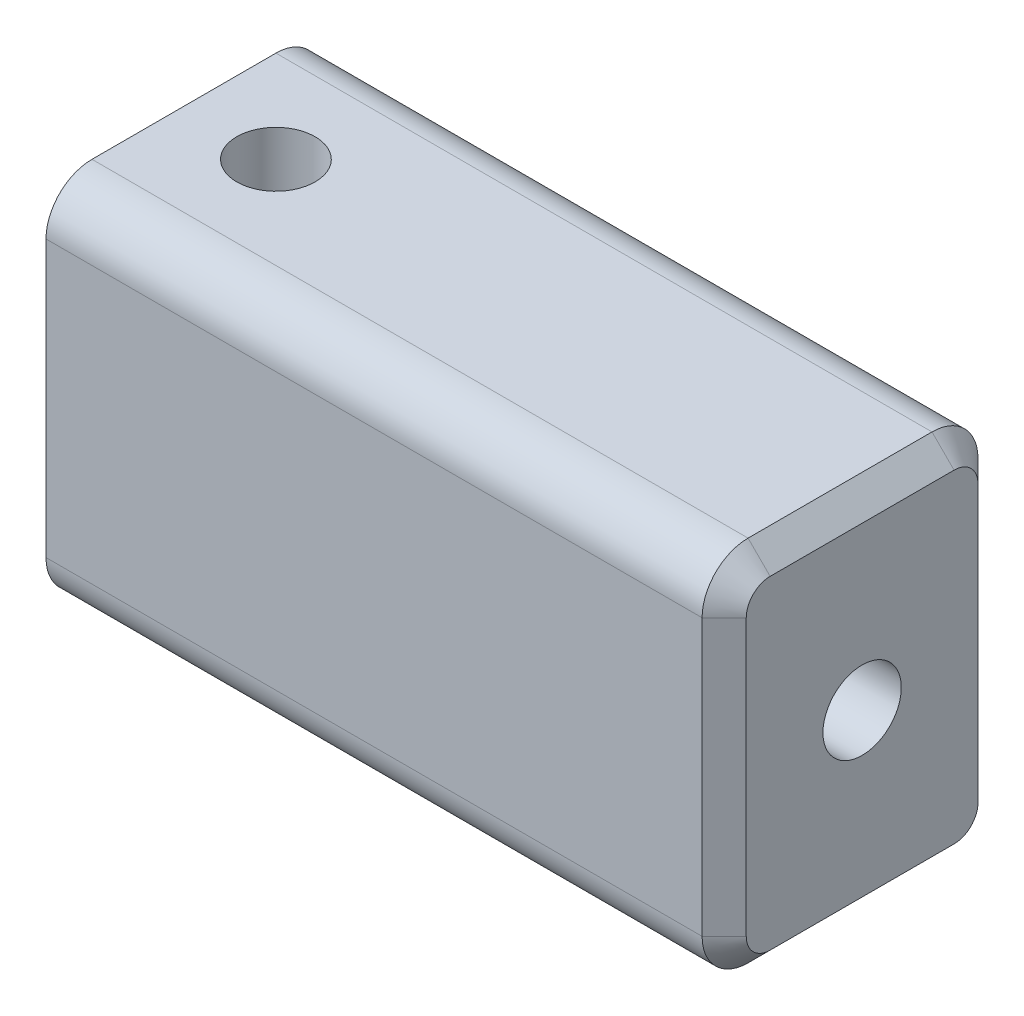
ISO-10303-21;
HEADER;
FILE_DESCRIPTION(('STEP AP214'),'2;1');
FILE_NAME('part.step','',(''),(''),'','','');
FILE_SCHEMA(('AUTOMOTIVE_DESIGN { 1 0 10303 214 1 1 1 1 }'));
ENDSEC;
DATA;
#1=APPLICATION_CONTEXT('core data for automotive mechanical design processes');
#2=APPLICATION_PROTOCOL_DEFINITION('international standard','automotive_design',2000,#1);
#3=PRODUCT_CONTEXT('',#1,'mechanical');
#4=PRODUCT('Part','Part','',(#3));
#5=PRODUCT_RELATED_PRODUCT_CATEGORY('part','',(#4));
#6=PRODUCT_DEFINITION_FORMATION('','',#4);
#7=PRODUCT_DEFINITION_CONTEXT('part definition',#1,'design');
#8=PRODUCT_DEFINITION('design','',#6,#7);
#9=PRODUCT_DEFINITION_SHAPE('','',#8);
#10=(LENGTH_UNIT() NAMED_UNIT(*) SI_UNIT(.MILLI.,.METRE.));
#11=(NAMED_UNIT(*) PLANE_ANGLE_UNIT() SI_UNIT($,.RADIAN.));
#12=(NAMED_UNIT(*) SI_UNIT($,.STERADIAN.) SOLID_ANGLE_UNIT());
#13=UNCERTAINTY_MEASURE_WITH_UNIT(LENGTH_MEASURE(1.E-05),#10,'distance_accuracy_value','');
#14=(GEOMETRIC_REPRESENTATION_CONTEXT(3) GLOBAL_UNCERTAINTY_ASSIGNED_CONTEXT((#13)) GLOBAL_UNIT_ASSIGNED_CONTEXT((#10,
#11,#12)) REPRESENTATION_CONTEXT('',''));
#15=CARTESIAN_POINT('',(0.,0.,0.));
#16=DIRECTION('',(0.,0.,1.));
#17=DIRECTION('',(1.,0.,0.));
#18=AXIS2_PLACEMENT_3D('',#15,#16,#17);
#19=CARTESIAN_POINT('',(39.28745,6.35,-4.7625));
#20=DIRECTION('',(0.,1.,0.));
#21=DIRECTION('',(0.,0.,1.));
#22=AXIS2_PLACEMENT_3D('',#19,#20,#21);
#23=PLANE('',#22);
#24=DIRECTION('',(-1.,0.,0.));
#25=VECTOR('',#24,1.);
#26=CARTESIAN_POINT('',(39.28745,6.35,3.175));
#27=LINE('',#26,#25);
#28=CARTESIAN_POINT('',(0.,6.35,3.175));
#29=VERTEX_POINT('',#28);
#30=CARTESIAN_POINT('',(22.65045,6.35,3.175));
#31=VERTEX_POINT('',#30);
#32=EDGE_CURVE('E518',#29,#31,#27,.F.);
#33=ORIENTED_EDGE('',*,*,#32,.T.);
#34=DIRECTION('',(0.,0.,-1.));
#35=VECTOR('',#34,1.);
#36=CARTESIAN_POINT('',(22.65045,6.35,-3.175));
#37=LINE('',#36,#35);
#38=CARTESIAN_POINT('',(22.65045,6.35,-3.175));
#39=VERTEX_POINT('',#38);
#40=EDGE_CURVE('E12',#31,#39,#37,.T.);
#41=ORIENTED_EDGE('',*,*,#40,.T.);
#42=DIRECTION('',(-1.,0.,0.));
#43=VECTOR('',#42,1.);
#44=CARTESIAN_POINT('',(39.28745,6.35,-3.175));
#45=LINE('',#44,#43);
#46=CARTESIAN_POINT('',(0.,6.35,-3.175));
#47=VERTEX_POINT('',#46);
#48=EDGE_CURVE('E520',#39,#47,#45,.T.);
#49=ORIENTED_EDGE('',*,*,#48,.T.);
#50=DIRECTION('',(0.,0.,-1.));
#51=VECTOR('',#50,1.);
#52=CARTESIAN_POINT('',(0.,6.35,-4.7625));
#53=LINE('',#52,#51);
#54=EDGE_CURVE('E497',#29,#47,#53,.T.);
#55=ORIENTED_EDGE('',*,*,#54,.F.);
#56=EDGE_LOOP('',(#33,#41,#49,#55));
#57=FACE_BOUND('',#56,.T.);
#58=CARTESIAN_POINT('',(3.175,6.35,0.));
#59=DIRECTION('',(0.,1.,0.));
#60=DIRECTION('',(0.,0.,1.));
#61=AXIS2_PLACEMENT_3D('',#58,#59,#60);
#62=CIRCLE('',#61,1.35255);
#63=CARTESIAN_POINT('',(3.175,6.35,1.35255));
#64=VERTEX_POINT('',#63);
#65=EDGE_CURVE('E468',#64,#64,#62,.T.);
#66=ORIENTED_EDGE('',*,*,#65,.F.);
#67=EDGE_LOOP('',(#66));
#68=FACE_BOUND('',#67,.T.);
#69=ADVANCED_FACE('F361',(#57,#68),#23,.T.);
#70=CARTESIAN_POINT('',(23.41345,0.,0.));
#71=DIRECTION('',(-1.,0.,0.));
#72=DIRECTION('',(0.,0.,1.));
#73=AXIS2_PLACEMENT_3D('',#70,#71,#72);
#74=CYLINDRICAL_SURFACE('',#73,1.35255);
#75=CARTESIAN_POINT('',(0.,0.,0.));
#76=DIRECTION('',(-1.,0.,0.));
#77=DIRECTION('',(0.,0.,1.));
#78=AXIS2_PLACEMENT_3D('',#75,#76,#77);
#79=CIRCLE('',#78,1.35255);
#80=CARTESIAN_POINT('',(0.,0.,1.35255));
#81=VERTEX_POINT('',#80);
#82=EDGE_CURVE('E482',#81,#81,#79,.T.);
#83=ORIENTED_EDGE('',*,*,#82,.T.);
#84=EDGE_LOOP('',(#83));
#85=FACE_BOUND('',#84,.T.);
#86=CARTESIAN_POINT('',(3.175,0.,0.));
#87=DIRECTION('',(-0.707106781186547,-0.707106781186547,0.));
#88=DIRECTION('',(0.707106781186547,-0.707106781186547,0.));
#89=AXIS2_PLACEMENT_3D('',#86,#87,#88);
#90=ELLIPSE('',#89,1.91279455378773,1.35255);
#91=CARTESIAN_POINT('',(3.175,0.,-1.35255));
#92=VERTEX_POINT('',#91);
#93=CARTESIAN_POINT('',(3.175,0.,1.35255));
#94=VERTEX_POINT('',#93);
#95=EDGE_CURVE('E457',#92,#94,#90,.F.);
#96=ORIENTED_EDGE('',*,*,#95,.T.);
#97=CARTESIAN_POINT('',(3.175,0.,0.));
#98=DIRECTION('',(-0.707106781186547,0.707106781186547,0.));
#99=DIRECTION('',(0.707106781186547,0.707106781186547,0.));
#100=AXIS2_PLACEMENT_3D('',#97,#98,#99);
#101=ELLIPSE('',#100,1.91279455378773,1.35255);
#102=EDGE_CURVE('E467',#92,#94,#101,.T.);
#103=ORIENTED_EDGE('',*,*,#102,.F.);
#104=EDGE_LOOP('',(#96,#103));
#105=FACE_BOUND('',#104,.T.);
#106=ADVANCED_FACE('F466',(#85,#105),#74,.F.);
#107=CARTESIAN_POINT('',(23.41245,0.,0.));
#108=DIRECTION('',(-1.,0.,0.));
#109=DIRECTION('',(0.,0.,1.));
#110=AXIS2_PLACEMENT_3D('',#107,#108,#109);
#111=CIRCLE('',#110,1.35255);
#112=CARTESIAN_POINT('',(23.41245,0.,1.35255));
#113=VERTEX_POINT('',#112);
#114=EDGE_CURVE('E485',#113,#113,#111,.F.);
#115=ORIENTED_EDGE('',*,*,#114,.T.);
#116=EDGE_LOOP('',(#115));
#117=FACE_BOUND('',#116,.T.);
#118=CARTESIAN_POINT('',(3.175,0.,0.));
#119=DIRECTION('',(0.707106781186547,-0.707106781186547,0.));
#120=DIRECTION('',(-0.707106781186547,-0.707106781186547,0.));
#121=AXIS2_PLACEMENT_3D('',#118,#119,#120);
#122=ELLIPSE('',#121,1.91279455378773,1.35255);
#123=EDGE_CURVE('E454',#94,#92,#122,.F.);
#124=ORIENTED_EDGE('',*,*,#123,.T.);
#125=CARTESIAN_POINT('',(3.175,0.,0.));
#126=DIRECTION('',(0.707106781186547,0.707106781186547,0.));
#127=DIRECTION('',(-0.707106781186547,0.707106781186547,0.));
#128=AXIS2_PLACEMENT_3D('',#125,#126,#127);
#129=ELLIPSE('',#128,1.91279455378773,1.35255);
#130=EDGE_CURVE('E472',#94,#92,#129,.T.);
#131=ORIENTED_EDGE('',*,*,#130,.F.);
#132=EDGE_LOOP('',(#124,#131));
#133=FACE_BOUND('',#132,.T.);
#134=ADVANCED_FACE('F475',(#117,#133),#74,.F.);
#135=CARTESIAN_POINT('',(0.,0.,0.));
#136=DIRECTION('',(1.,0.,0.));
#137=DIRECTION('',(0.,0.,-1.));
#138=AXIS2_PLACEMENT_3D('',#135,#136,#137);
#139=PLANE('',#138);
#140=ORIENTED_EDGE('',*,*,#82,.F.);
#141=EDGE_LOOP('',(#140));
#142=FACE_BOUND('',#141,.T.);
#143=DIRECTION('',(0.,-1.,0.));
#144=VECTOR('',#143,1.);
#145=CARTESIAN_POINT('',(0.,-6.35,-4.7625));
#146=LINE('',#145,#144);
#147=CARTESIAN_POINT('',(0.,4.7625,-4.7625));
#148=VERTEX_POINT('',#147);
#149=CARTESIAN_POINT('',(0.,-4.7625,-4.7625));
#150=VERTEX_POINT('',#149);
#151=EDGE_CURVE('E488',#148,#150,#146,.T.);
#152=ORIENTED_EDGE('',*,*,#151,.T.);
#153=CARTESIAN_POINT('',(0.,-4.7625,-3.175));
#154=DIRECTION('',(1.,0.,0.));
#155=DIRECTION('',(0.,0.,-1.));
#156=AXIS2_PLACEMENT_3D('',#153,#154,#155);
#157=CIRCLE('',#156,1.5875);
#158=CARTESIAN_POINT('',(0.,-6.35,-3.175));
#159=VERTEX_POINT('',#158);
#160=EDGE_CURVE('E511',#150,#159,#157,.F.);
#161=ORIENTED_EDGE('',*,*,#160,.T.);
#162=DIRECTION('',(0.,0.,1.));
#163=VECTOR('',#162,1.);
#164=CARTESIAN_POINT('',(0.,-6.35,-4.7625));
#165=LINE('',#164,#163);
#166=CARTESIAN_POINT('',(0.,-6.35,3.175));
#167=VERTEX_POINT('',#166);
#168=EDGE_CURVE('E491',#159,#167,#165,.T.);
#169=ORIENTED_EDGE('',*,*,#168,.T.);
#170=CARTESIAN_POINT('',(0.,-4.7625,3.175));
#171=DIRECTION('',(1.,0.,0.));
#172=DIRECTION('',(0.,0.,-1.));
#173=AXIS2_PLACEMENT_3D('',#170,#171,#172);
#174=CIRCLE('',#173,1.5875);
#175=CARTESIAN_POINT('',(0.,-4.7625,4.7625));
#176=VERTEX_POINT('',#175);
#177=EDGE_CURVE('E505',#167,#176,#174,.F.);
#178=ORIENTED_EDGE('',*,*,#177,.T.);
#179=DIRECTION('',(0.,1.,0.));
#180=VECTOR('',#179,1.);
#181=CARTESIAN_POINT('',(0.,-6.35,4.7625));
#182=LINE('',#181,#180);
#183=CARTESIAN_POINT('',(0.,4.7625,4.7625));
#184=VERTEX_POINT('',#183);
#185=EDGE_CURVE('E494',#176,#184,#182,.T.);
#186=ORIENTED_EDGE('',*,*,#185,.T.);
#187=CARTESIAN_POINT('',(0.,4.7625,3.175));
#188=DIRECTION('',(1.,0.,0.));
#189=DIRECTION('',(0.,0.,-1.));
#190=AXIS2_PLACEMENT_3D('',#187,#188,#189);
#191=CIRCLE('',#190,1.5875);
#192=EDGE_CURVE('E507',#184,#29,#191,.F.);
#193=ORIENTED_EDGE('',*,*,#192,.T.);
#194=ORIENTED_EDGE('',*,*,#54,.T.);
#195=CARTESIAN_POINT('',(0.,4.7625,-3.175));
#196=DIRECTION('',(1.,0.,0.));
#197=DIRECTION('',(0.,0.,-1.));
#198=AXIS2_PLACEMENT_3D('',#195,#196,#197);
#199=CIRCLE('',#198,1.5875);
#200=EDGE_CURVE('E509',#47,#148,#199,.F.);
#201=ORIENTED_EDGE('',*,*,#200,.T.);
#202=EDGE_LOOP('',(#152,#161,#169,#178,#186,#193,#194,#201));
#203=FACE_BOUND('',#202,.T.);
#204=ADVANCED_FACE('F363',(#142,#203),#139,.F.);
#205=CARTESIAN_POINT('',(39.28745,-6.35,-4.7625));
#206=DIRECTION('',(0.,0.,-1.));
#207=DIRECTION('',(-1.,0.,0.));
#208=AXIS2_PLACEMENT_3D('',#205,#206,#207);
#209=PLANE('',#208);
#210=DIRECTION('',(-1.,0.,0.));
#211=VECTOR('',#210,1.);
#212=CARTESIAN_POINT('',(39.28745,4.7625,-4.7625));
#213=LINE('',#212,#211);
#214=CARTESIAN_POINT('',(22.65045,4.7625,-4.7625));
#215=VERTEX_POINT('',#214);
#216=EDGE_CURVE('E500',#148,#215,#213,.F.);
#217=ORIENTED_EDGE('',*,*,#216,.T.);
#218=DIRECTION('',(0.,-1.,0.));
#219=VECTOR('',#218,1.);
#220=CARTESIAN_POINT('',(22.65045,-4.7625,-4.7625));
#221=LINE('',#220,#219);
#222=CARTESIAN_POINT('',(22.65045,-4.7625,-4.7625));
#223=VERTEX_POINT('',#222);
#224=EDGE_CURVE('E551',#215,#223,#221,.T.);
#225=ORIENTED_EDGE('',*,*,#224,.T.);
#226=DIRECTION('',(-1.,0.,0.));
#227=VECTOR('',#226,1.);
#228=CARTESIAN_POINT('',(39.28745,-4.7625,-4.7625));
#229=LINE('',#228,#227);
#230=EDGE_CURVE('E503',#223,#150,#229,.T.);
#231=ORIENTED_EDGE('',*,*,#230,.T.);
#232=ORIENTED_EDGE('',*,*,#151,.F.);
#233=EDGE_LOOP('',(#217,#225,#231,#232));
#234=FACE_BOUND('',#233,.T.);
#235=ADVANCED_FACE('F567',(#234),#209,.T.);
#236=CARTESIAN_POINT('',(39.28745,-6.35,4.7625));
#237=DIRECTION('',(0.,0.,1.));
#238=DIRECTION('',(1.,0.,0.));
#239=AXIS2_PLACEMENT_3D('',#236,#237,#238);
#240=PLANE('',#239);
#241=DIRECTION('',(-1.,0.,0.));
#242=VECTOR('',#241,1.);
#243=CARTESIAN_POINT('',(39.28745,-4.7625,4.7625));
#244=LINE('',#243,#242);
#245=CARTESIAN_POINT('',(22.65045,-4.7625,4.7625));
#246=VERTEX_POINT('',#245);
#247=EDGE_CURVE('E522',#176,#246,#244,.F.);
#248=ORIENTED_EDGE('',*,*,#247,.T.);
#249=DIRECTION('',(0.,1.,0.));
#250=VECTOR('',#249,1.);
#251=CARTESIAN_POINT('',(22.65045,4.7625,4.7625));
#252=LINE('',#251,#250);
#253=CARTESIAN_POINT('',(22.65045,4.7625,4.7625));
#254=VERTEX_POINT('',#253);
#255=EDGE_CURVE('E553',#246,#254,#252,.T.);
#256=ORIENTED_EDGE('',*,*,#255,.T.);
#257=DIRECTION('',(-1.,0.,0.));
#258=VECTOR('',#257,1.);
#259=CARTESIAN_POINT('',(39.28745,4.7625,4.7625));
#260=LINE('',#259,#258);
#261=EDGE_CURVE('E525',#254,#184,#260,.T.);
#262=ORIENTED_EDGE('',*,*,#261,.T.);
#263=ORIENTED_EDGE('',*,*,#185,.F.);
#264=EDGE_LOOP('',(#248,#256,#262,#263));
#265=FACE_BOUND('',#264,.T.);
#266=ADVANCED_FACE('F618',(#265),#240,.T.);
#267=CARTESIAN_POINT('',(39.28745,-6.35,-4.7625));
#268=DIRECTION('',(0.,-1.,0.));
#269=DIRECTION('',(0.,0.,-1.));
#270=AXIS2_PLACEMENT_3D('',#267,#268,#269);
#271=PLANE('',#270);
#272=CARTESIAN_POINT('',(3.175,-6.35,0.));
#273=DIRECTION('',(0.,-1.,0.));
#274=DIRECTION('',(0.,0.,-1.));
#275=AXIS2_PLACEMENT_3D('',#272,#273,#274);
#276=CIRCLE('',#275,1.35255);
#277=CARTESIAN_POINT('',(3.175,-6.35,-1.35255));
#278=VERTEX_POINT('',#277);
#279=EDGE_CURVE('E473',#278,#278,#276,.F.);
#280=ORIENTED_EDGE('',*,*,#279,.T.);
#281=EDGE_LOOP('',(#280));
#282=FACE_BOUND('',#281,.T.);
#283=DIRECTION('',(-1.,0.,0.));
#284=VECTOR('',#283,1.);
#285=CARTESIAN_POINT('',(39.28745,-6.35,-3.175));
#286=LINE('',#285,#284);
#287=CARTESIAN_POINT('',(22.65045,-6.35,-3.175));
#288=VERTEX_POINT('',#287);
#289=EDGE_CURVE('E515',#159,#288,#286,.F.);
#290=ORIENTED_EDGE('',*,*,#289,.T.);
#291=DIRECTION('',(0.,0.,1.));
#292=VECTOR('',#291,1.);
#293=CARTESIAN_POINT('',(22.65045,-6.35,3.175));
#294=LINE('',#293,#292);
#295=CARTESIAN_POINT('',(22.65045,-6.35,3.175));
#296=VERTEX_POINT('',#295);
#297=EDGE_CURVE('E544',#288,#296,#294,.T.);
#298=ORIENTED_EDGE('',*,*,#297,.T.);
#299=DIRECTION('',(-1.,0.,0.));
#300=VECTOR('',#299,1.);
#301=CARTESIAN_POINT('',(39.28745,-6.35,3.175));
#302=LINE('',#301,#300);
#303=EDGE_CURVE('E513',#296,#167,#302,.T.);
#304=ORIENTED_EDGE('',*,*,#303,.T.);
#305=ORIENTED_EDGE('',*,*,#168,.F.);
#306=EDGE_LOOP('',(#290,#298,#304,#305));
#307=FACE_BOUND('',#306,.T.);
#308=ADVANCED_FACE('F598',(#282,#307),#271,.T.);
#309=CARTESIAN_POINT('',(23.41245,4.7625,0.));
#310=DIRECTION('',(-1.,0.,0.));
#311=DIRECTION('',(0.,0.,1.));
#312=AXIS2_PLACEMENT_3D('',#309,#310,#311);
#313=PLANE('',#312);
#314=CARTESIAN_POINT('',(23.41245,-4.7625,3.175));
#315=DIRECTION('',(-1.,0.,0.));
#316=DIRECTION('',(0.,0.,1.));
#317=AXIS2_PLACEMENT_3D('',#314,#315,#316);
#318=CIRCLE('',#317,0.825500000000002);
#319=CARTESIAN_POINT('',(23.41245,-4.7625,4.0005));
#320=VERTEX_POINT('',#319);
#321=CARTESIAN_POINT('',(23.41245,-5.588,3.175));
#322=VERTEX_POINT('',#321);
#323=EDGE_CURVE('E537',#320,#322,#318,.F.);
#324=ORIENTED_EDGE('',*,*,#323,.T.);
#325=DIRECTION('',(0.,0.,-1.));
#326=VECTOR('',#325,1.);
#327=CARTESIAN_POINT('',(23.41245,-5.588,-3.175));
#328=LINE('',#327,#326);
#329=CARTESIAN_POINT('',(23.41245,-5.588,-3.175));
#330=VERTEX_POINT('',#329);
#331=EDGE_CURVE('E541',#322,#330,#328,.T.);
#332=ORIENTED_EDGE('',*,*,#331,.T.);
#333=CARTESIAN_POINT('',(23.41245,-4.7625,-3.175));
#334=DIRECTION('',(-1.,0.,0.));
#335=DIRECTION('',(0.,0.,1.));
#336=AXIS2_PLACEMENT_3D('',#333,#334,#335);
#337=CIRCLE('',#336,0.825500000000001);
#338=CARTESIAN_POINT('',(23.41245,-4.7625,-4.0005));
#339=VERTEX_POINT('',#338);
#340=EDGE_CURVE('E539',#330,#339,#337,.F.);
#341=ORIENTED_EDGE('',*,*,#340,.T.);
#342=DIRECTION('',(0.,1.,0.));
#343=VECTOR('',#342,1.);
#344=CARTESIAN_POINT('',(23.41245,4.7625,-4.0005));
#345=LINE('',#344,#343);
#346=CARTESIAN_POINT('',(23.41245,4.7625,-4.0005));
#347=VERTEX_POINT('',#346);
#348=EDGE_CURVE('E535',#339,#347,#345,.T.);
#349=ORIENTED_EDGE('',*,*,#348,.T.);
#350=CARTESIAN_POINT('',(23.41245,4.7625,-3.175));
#351=DIRECTION('',(-1.,0.,0.));
#352=DIRECTION('',(0.,0.,1.));
#353=AXIS2_PLACEMENT_3D('',#350,#351,#352);
#354=CIRCLE('',#353,0.825500000000002);
#355=CARTESIAN_POINT('',(23.41245,5.588,-3.175));
#356=VERTEX_POINT('',#355);
#357=EDGE_CURVE('E531',#347,#356,#354,.F.);
#358=ORIENTED_EDGE('',*,*,#357,.T.);
#359=DIRECTION('',(0.,0.,1.));
#360=VECTOR('',#359,1.);
#361=CARTESIAN_POINT('',(23.41245,5.588,3.175));
#362=LINE('',#361,#360);
#363=CARTESIAN_POINT('',(23.41245,5.588,3.175));
#364=VERTEX_POINT('',#363);
#365=EDGE_CURVE('E527',#356,#364,#362,.T.);
#366=ORIENTED_EDGE('',*,*,#365,.T.);
#367=CARTESIAN_POINT('',(23.41245,4.7625,3.175));
#368=DIRECTION('',(-1.,0.,0.));
#369=DIRECTION('',(0.,0.,1.));
#370=AXIS2_PLACEMENT_3D('',#367,#368,#369);
#371=CIRCLE('',#370,0.825500000000001);
#372=CARTESIAN_POINT('',(23.41245,4.7625,4.0005));
#373=VERTEX_POINT('',#372);
#374=EDGE_CURVE('E529',#364,#373,#371,.F.);
#375=ORIENTED_EDGE('',*,*,#374,.T.);
#376=DIRECTION('',(0.,-1.,0.));
#377=VECTOR('',#376,1.);
#378=CARTESIAN_POINT('',(23.41245,-4.7625,4.0005));
#379=LINE('',#378,#377);
#380=EDGE_CURVE('E533',#373,#320,#379,.T.);
#381=ORIENTED_EDGE('',*,*,#380,.T.);
#382=EDGE_LOOP('',(#324,#332,#341,#349,#358,#366,#375,#381));
#383=FACE_BOUND('',#382,.T.);
#384=ORIENTED_EDGE('',*,*,#114,.F.);
#385=EDGE_LOOP('',(#384));
#386=FACE_BOUND('',#385,.T.);
#387=ADVANCED_FACE('F638',(#383,#386),#313,.F.);
#388=CARTESIAN_POINT('',(3.175,-6.351,0.));
#389=DIRECTION('',(0.,1.,0.));
#390=DIRECTION('',(0.,0.,1.));
#391=AXIS2_PLACEMENT_3D('',#388,#389,#390);
#392=CYLINDRICAL_SURFACE('',#391,1.35255);
#393=ORIENTED_EDGE('',*,*,#279,.F.);
#394=EDGE_LOOP('',(#393));
#395=FACE_BOUND('',#394,.T.);
#396=ORIENTED_EDGE('',*,*,#102,.T.);
#397=ORIENTED_EDGE('',*,*,#130,.T.);
#398=EDGE_LOOP('',(#396,#397));
#399=FACE_BOUND('',#398,.T.);
#400=ADVANCED_FACE('F471',(#395,#399),#392,.F.);
#401=CARTESIAN_POINT('',(3.175,6.351,0.));
#402=DIRECTION('',(0.,-1.,0.));
#403=DIRECTION('',(0.,0.,-1.));
#404=AXIS2_PLACEMENT_3D('',#401,#402,#403);
#405=CYLINDRICAL_SURFACE('',#404,1.35255);
#406=ORIENTED_EDGE('',*,*,#65,.T.);
#407=EDGE_LOOP('',(#406));
#408=FACE_BOUND('',#407,.T.);
#409=ORIENTED_EDGE('',*,*,#123,.F.);
#410=ORIENTED_EDGE('',*,*,#95,.F.);
#411=EDGE_LOOP('',(#409,#410));
#412=FACE_BOUND('',#411,.T.);
#413=ADVANCED_FACE('F456',(#408,#412),#405,.F.);
#414=CARTESIAN_POINT('',(39.28745,-4.7625,-3.175));
#415=DIRECTION('',(-1.,0.,0.));
#416=DIRECTION('',(0.,0.,1.));
#417=AXIS2_PLACEMENT_3D('',#414,#415,#416);
#418=CYLINDRICAL_SURFACE('',#417,1.5875);
#419=ORIENTED_EDGE('',*,*,#230,.F.);
#420=CARTESIAN_POINT('',(22.65045,-4.7625,-3.175));
#421=DIRECTION('',(-1.,0.,0.));
#422=DIRECTION('',(0.,0.,1.));
#423=AXIS2_PLACEMENT_3D('',#420,#421,#422);
#424=CIRCLE('',#423,1.5875);
#425=EDGE_CURVE('E547',#223,#288,#424,.T.);
#426=ORIENTED_EDGE('',*,*,#425,.T.);
#427=ORIENTED_EDGE('',*,*,#289,.F.);
#428=ORIENTED_EDGE('',*,*,#160,.F.);
#429=EDGE_LOOP('',(#419,#426,#427,#428));
#430=FACE_BOUND('',#429,.T.);
#431=ADVANCED_FACE('F593',(#430),#418,.T.);
#432=CARTESIAN_POINT('',(39.28745,4.7625,-3.175));
#433=DIRECTION('',(-1.,0.,0.));
#434=DIRECTION('',(0.,0.,1.));
#435=AXIS2_PLACEMENT_3D('',#432,#433,#434);
#436=CYLINDRICAL_SURFACE('',#435,1.5875);
#437=ORIENTED_EDGE('',*,*,#48,.F.);
#438=CARTESIAN_POINT('',(22.65045,4.7625,-3.175));
#439=DIRECTION('',(-1.,0.,0.));
#440=DIRECTION('',(0.,0.,1.));
#441=AXIS2_PLACEMENT_3D('',#438,#439,#440);
#442=CIRCLE('',#441,1.5875);
#443=EDGE_CURVE('E555',#39,#215,#442,.T.);
#444=ORIENTED_EDGE('',*,*,#443,.T.);
#445=ORIENTED_EDGE('',*,*,#216,.F.);
#446=ORIENTED_EDGE('',*,*,#200,.F.);
#447=EDGE_LOOP('',(#437,#444,#445,#446));
#448=FACE_BOUND('',#447,.T.);
#449=ADVANCED_FACE('F559',(#448),#436,.T.);
#450=CARTESIAN_POINT('',(39.28745,4.7625,3.175));
#451=DIRECTION('',(-1.,0.,0.));
#452=DIRECTION('',(0.,0.,1.));
#453=AXIS2_PLACEMENT_3D('',#450,#451,#452);
#454=CYLINDRICAL_SURFACE('',#453,1.5875);
#455=ORIENTED_EDGE('',*,*,#261,.F.);
#456=CARTESIAN_POINT('',(22.65045,4.7625,3.175));
#457=DIRECTION('',(-1.,0.,0.));
#458=DIRECTION('',(0.,0.,1.));
#459=AXIS2_PLACEMENT_3D('',#456,#457,#458);
#460=CIRCLE('',#459,1.5875);
#461=EDGE_CURVE('E369',#254,#31,#460,.T.);
#462=ORIENTED_EDGE('',*,*,#461,.T.);
#463=ORIENTED_EDGE('',*,*,#32,.F.);
#464=ORIENTED_EDGE('',*,*,#192,.F.);
#465=EDGE_LOOP('',(#455,#462,#463,#464));
#466=FACE_BOUND('',#465,.T.);
#467=ADVANCED_FACE('F694',(#466),#454,.T.);
#468=CARTESIAN_POINT('',(39.28745,-4.7625,3.175));
#469=DIRECTION('',(-1.,0.,0.));
#470=DIRECTION('',(0.,0.,1.));
#471=AXIS2_PLACEMENT_3D('',#468,#469,#470);
#472=CYLINDRICAL_SURFACE('',#471,1.5875);
#473=ORIENTED_EDGE('',*,*,#303,.F.);
#474=CARTESIAN_POINT('',(22.65045,-4.7625,3.175));
#475=DIRECTION('',(-1.,0.,0.));
#476=DIRECTION('',(0.,0.,1.));
#477=AXIS2_PLACEMENT_3D('',#474,#475,#476);
#478=CIRCLE('',#477,1.5875);
#479=EDGE_CURVE('E549',#296,#246,#478,.T.);
#480=ORIENTED_EDGE('',*,*,#479,.T.);
#481=ORIENTED_EDGE('',*,*,#247,.F.);
#482=ORIENTED_EDGE('',*,*,#177,.F.);
#483=EDGE_LOOP('',(#473,#480,#481,#482));
#484=FACE_BOUND('',#483,.T.);
#485=ADVANCED_FACE('F613',(#484),#472,.T.);
#486=CARTESIAN_POINT('',(23.41245,5.588,0.));
#487=DIRECTION('',(0.707106781186546,0.707106781186549,0.));
#488=DIRECTION('',(-0.707106781186549,0.707106781186546,0.));
#489=AXIS2_PLACEMENT_3D('',#486,#487,#488);
#490=PLANE('',#489);
#491=DIRECTION('',(0.707106781186549,-0.707106781186546,0.));
#492=VECTOR('',#491,1.);
#493=CARTESIAN_POINT('',(22.65045,6.35,-3.175));
#494=LINE('',#493,#492);
#495=EDGE_CURVE('E626',#39,#356,#494,.T.);
#496=ORIENTED_EDGE('',*,*,#495,.F.);
#497=ORIENTED_EDGE('',*,*,#40,.F.);
#498=DIRECTION('',(-0.707106781186549,0.707106781186546,0.));
#499=VECTOR('',#498,1.);
#500=CARTESIAN_POINT('',(23.41245,5.588,3.175));
#501=LINE('',#500,#499);
#502=EDGE_CURVE('E461',#364,#31,#501,.T.);
#503=ORIENTED_EDGE('',*,*,#502,.F.);
#504=ORIENTED_EDGE('',*,*,#365,.F.);
#505=EDGE_LOOP('',(#496,#497,#503,#504));
#506=FACE_BOUND('',#505,.T.);
#507=ADVANCED_FACE('F636',(#506),#490,.T.);
#508=CARTESIAN_POINT('',(23.41245,4.7625,3.175));
#509=DIRECTION('',(-1.,0.,0.));
#510=DIRECTION('',(0.,0.,1.));
#511=AXIS2_PLACEMENT_3D('',#508,#509,#510);
#512=CONICAL_SURFACE('',#511,0.825500000000001,0.785398163397446);
#513=ORIENTED_EDGE('',*,*,#502,.T.);
#514=ORIENTED_EDGE('',*,*,#461,.F.);
#515=DIRECTION('',(-0.707106781186549,0.,0.707106781186546));
#516=VECTOR('',#515,1.);
#517=CARTESIAN_POINT('',(23.41245,4.7625,4.0005));
#518=LINE('',#517,#516);
#519=EDGE_CURVE('E576',#373,#254,#518,.T.);
#520=ORIENTED_EDGE('',*,*,#519,.F.);
#521=ORIENTED_EDGE('',*,*,#374,.F.);
#522=EDGE_LOOP('',(#513,#514,#520,#521));
#523=FACE_BOUND('',#522,.T.);
#524=ADVANCED_FACE('F633',(#523),#512,.T.);
#525=CARTESIAN_POINT('',(23.41245,4.7625,-3.175));
#526=DIRECTION('',(-1.,0.,0.));
#527=DIRECTION('',(0.,0.,1.));
#528=AXIS2_PLACEMENT_3D('',#525,#526,#527);
#529=CONICAL_SURFACE('',#528,0.825500000000002,0.785398163397446);
#530=ORIENTED_EDGE('',*,*,#495,.T.);
#531=ORIENTED_EDGE('',*,*,#357,.F.);
#532=DIRECTION('',(0.707106781186549,0.,0.707106781186546));
#533=VECTOR('',#532,1.);
#534=CARTESIAN_POINT('',(22.65045,4.7625,-4.7625));
#535=LINE('',#534,#533);
#536=EDGE_CURVE('E572',#215,#347,#535,.T.);
#537=ORIENTED_EDGE('',*,*,#536,.F.);
#538=ORIENTED_EDGE('',*,*,#443,.F.);
#539=EDGE_LOOP('',(#530,#531,#537,#538));
#540=FACE_BOUND('',#539,.T.);
#541=ADVANCED_FACE('F573',(#540),#529,.T.);
#542=CARTESIAN_POINT('',(23.41245,4.7625,4.0005));
#543=DIRECTION('',(0.707106781186546,0.,0.707106781186549));
#544=DIRECTION('',(0.707106781186549,0.,-0.707106781186546));
#545=AXIS2_PLACEMENT_3D('',#542,#543,#544);
#546=PLANE('',#545);
#547=ORIENTED_EDGE('',*,*,#519,.T.);
#548=ORIENTED_EDGE('',*,*,#255,.F.);
#549=DIRECTION('',(-0.707106781186549,0.,0.707106781186546));
#550=VECTOR('',#549,1.);
#551=CARTESIAN_POINT('',(23.41245,-4.7625,4.0005));
#552=LINE('',#551,#550);
#553=EDGE_CURVE('E577',#320,#246,#552,.T.);
#554=ORIENTED_EDGE('',*,*,#553,.F.);
#555=ORIENTED_EDGE('',*,*,#380,.F.);
#556=EDGE_LOOP('',(#547,#548,#554,#555));
#557=FACE_BOUND('',#556,.T.);
#558=ADVANCED_FACE('F621',(#557),#546,.T.);
#559=CARTESIAN_POINT('',(23.41245,4.7625,-4.0005));
#560=DIRECTION('',(0.707106781186546,0.,-0.707106781186549));
#561=DIRECTION('',(-0.707106781186549,0.,-0.707106781186546));
#562=AXIS2_PLACEMENT_3D('',#559,#560,#561);
#563=PLANE('',#562);
#564=ORIENTED_EDGE('',*,*,#536,.T.);
#565=ORIENTED_EDGE('',*,*,#348,.F.);
#566=DIRECTION('',(0.707106781186549,0.,0.707106781186546));
#567=VECTOR('',#566,1.);
#568=CARTESIAN_POINT('',(22.65045,-4.7625,-4.7625));
#569=LINE('',#568,#567);
#570=EDGE_CURVE('E582',#223,#339,#569,.T.);
#571=ORIENTED_EDGE('',*,*,#570,.F.);
#572=ORIENTED_EDGE('',*,*,#224,.F.);
#573=EDGE_LOOP('',(#564,#565,#571,#572));
#574=FACE_BOUND('',#573,.T.);
#575=ADVANCED_FACE('F580',(#574),#563,.T.);
#576=CARTESIAN_POINT('',(23.41245,-4.7625,3.175));
#577=DIRECTION('',(-1.,0.,0.));
#578=DIRECTION('',(0.,0.,1.));
#579=AXIS2_PLACEMENT_3D('',#576,#577,#578);
#580=CONICAL_SURFACE('',#579,0.825500000000002,0.785398163397446);
#581=ORIENTED_EDGE('',*,*,#553,.T.);
#582=ORIENTED_EDGE('',*,*,#479,.F.);
#583=DIRECTION('',(-0.707106781186549,-0.707106781186546,0.));
#584=VECTOR('',#583,1.);
#585=CARTESIAN_POINT('',(23.41245,-5.588,3.175));
#586=LINE('',#585,#584);
#587=EDGE_CURVE('E586',#322,#296,#586,.T.);
#588=ORIENTED_EDGE('',*,*,#587,.F.);
#589=ORIENTED_EDGE('',*,*,#323,.F.);
#590=EDGE_LOOP('',(#581,#582,#588,#589));
#591=FACE_BOUND('',#590,.T.);
#592=ADVANCED_FACE('F609',(#591),#580,.T.);
#593=CARTESIAN_POINT('',(23.41245,-4.7625,-3.175));
#594=DIRECTION('',(-1.,0.,0.));
#595=DIRECTION('',(0.,0.,1.));
#596=AXIS2_PLACEMENT_3D('',#593,#594,#595);
#597=CONICAL_SURFACE('',#596,0.825500000000001,0.785398163397446);
#598=ORIENTED_EDGE('',*,*,#570,.T.);
#599=ORIENTED_EDGE('',*,*,#340,.F.);
#600=DIRECTION('',(0.707106781186549,0.707106781186546,0.));
#601=VECTOR('',#600,1.);
#602=CARTESIAN_POINT('',(22.65045,-6.35,-3.175));
#603=LINE('',#602,#601);
#604=EDGE_CURVE('E590',#288,#330,#603,.T.);
#605=ORIENTED_EDGE('',*,*,#604,.F.);
#606=ORIENTED_EDGE('',*,*,#425,.F.);
#607=EDGE_LOOP('',(#598,#599,#605,#606));
#608=FACE_BOUND('',#607,.T.);
#609=ADVANCED_FACE('F589',(#608),#597,.T.);
#610=CARTESIAN_POINT('',(23.41245,-5.588,0.));
#611=DIRECTION('',(0.707106781186546,-0.707106781186549,0.));
#612=DIRECTION('',(0.707106781186549,0.707106781186546,0.));
#613=AXIS2_PLACEMENT_3D('',#610,#611,#612);
#614=PLANE('',#613);
#615=ORIENTED_EDGE('',*,*,#587,.T.);
#616=ORIENTED_EDGE('',*,*,#297,.F.);
#617=ORIENTED_EDGE('',*,*,#604,.T.);
#618=ORIENTED_EDGE('',*,*,#331,.F.);
#619=EDGE_LOOP('',(#615,#616,#617,#618));
#620=FACE_BOUND('',#619,.T.);
#621=ADVANCED_FACE('F601',(#620),#614,.T.);
#622=CLOSED_SHELL('',(#69,#106,#134,#204,#235,#266,#308,#387,#400,#413,#431,#449,#467,#485,#507,
#524,#541,#558,#575,#592,#609,#621));
#623=MANIFOLD_SOLID_BREP('B2',#622);
#624=ADVANCED_BREP_SHAPE_REPRESENTATION('',(#18,#623),#14);
#625=SHAPE_DEFINITION_REPRESENTATION(#9,#624);
ENDSEC;
END-ISO-10303-21;
